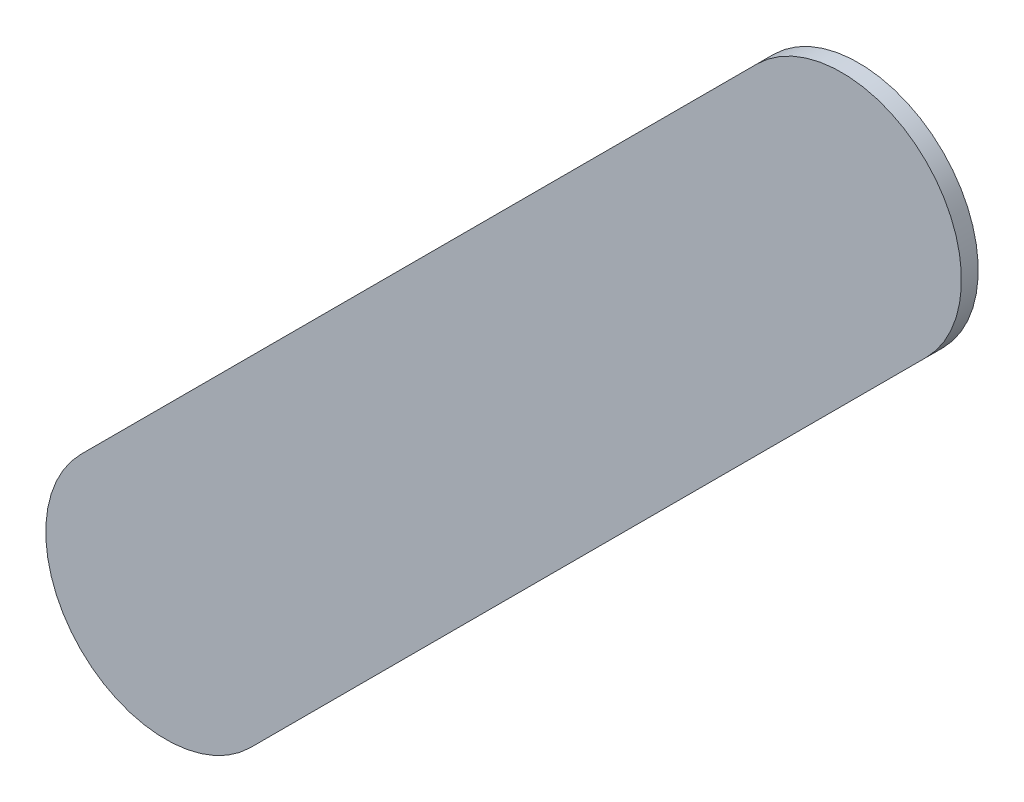
ISO-10303-21;
HEADER;
FILE_DESCRIPTION(('STEP AP214'),'2;1');
FILE_NAME('part.step','',(''),(''),'','','');
FILE_SCHEMA(('AUTOMOTIVE_DESIGN { 1 0 10303 214 1 1 1 1 }'));
ENDSEC;
DATA;
#1=APPLICATION_CONTEXT('core data for automotive mechanical design processes');
#2=APPLICATION_PROTOCOL_DEFINITION('international standard','automotive_design',2000,#1);
#3=PRODUCT_CONTEXT('',#1,'mechanical');
#4=PRODUCT('Part','Part','',(#3));
#5=PRODUCT_RELATED_PRODUCT_CATEGORY('part','',(#4));
#6=PRODUCT_DEFINITION_FORMATION('','',#4);
#7=PRODUCT_DEFINITION_CONTEXT('part definition',#1,'design');
#8=PRODUCT_DEFINITION('design','',#6,#7);
#9=PRODUCT_DEFINITION_SHAPE('','',#8);
#10=(LENGTH_UNIT() NAMED_UNIT(*) SI_UNIT(.MILLI.,.METRE.));
#11=(NAMED_UNIT(*) PLANE_ANGLE_UNIT() SI_UNIT($,.RADIAN.));
#12=(NAMED_UNIT(*) SI_UNIT($,.STERADIAN.) SOLID_ANGLE_UNIT());
#13=UNCERTAINTY_MEASURE_WITH_UNIT(LENGTH_MEASURE(1.E-05),#10,'distance_accuracy_value','');
#14=(GEOMETRIC_REPRESENTATION_CONTEXT(3) GLOBAL_UNCERTAINTY_ASSIGNED_CONTEXT((#13)) GLOBAL_UNIT_ASSIGNED_CONTEXT((#10,
#11,#12)) REPRESENTATION_CONTEXT('',''));
#15=CARTESIAN_POINT('',(0.,0.,0.));
#16=DIRECTION('',(0.,0.,1.));
#17=DIRECTION('',(1.,0.,0.));
#18=AXIS2_PLACEMENT_3D('',#15,#16,#17);
#19=CARTESIAN_POINT('',(134.528776,-110.680776,0.));
#20=DIRECTION('',(0.,0.,1.));
#21=DIRECTION('',(1.,0.,0.));
#22=AXIS2_PLACEMENT_3D('',#19,#20,#21);
#23=PLANE('',#22);
#24=DIRECTION('',(0.707106781186548,0.707106781186548,0.));
#25=VECTOR('',#24,1.);
#26=CARTESIAN_POINT('',(134.528776,-110.680776,0.));
#27=LINE('',#26,#25);
#28=CARTESIAN_POINT('',(134.528776,-110.680776,0.));
#29=VERTEX_POINT('',#28);
#30=CARTESIAN_POINT('',(135.939776,-109.269776,0.));
#31=VERTEX_POINT('',#30);
#32=EDGE_CURVE('E90',#29,#31,#27,.T.);
#33=ORIENTED_EDGE('',*,*,#32,.T.);
#34=CARTESIAN_POINT('',(135.7629995,-109.0929995,0.));
#35=DIRECTION('',(0.,0.,1.));
#36=DIRECTION('',(0.707106781186548,-0.707106781186548,0.));
#37=AXIS2_PLACEMENT_3D('',#34,#35,#36);
#38=CIRCLE('',#37,0.249999723809);
#39=CARTESIAN_POINT('',(135.586223,-108.916223,0.));
#40=VERTEX_POINT('',#39);
#41=EDGE_CURVE('E85',#31,#40,#38,.T.);
#42=ORIENTED_EDGE('',*,*,#41,.T.);
#43=DIRECTION('',(-0.707106781186548,-0.707106781186548,0.));
#44=VECTOR('',#43,1.);
#45=CARTESIAN_POINT('',(135.586223,-108.916223,0.));
#46=LINE('',#45,#44);
#47=CARTESIAN_POINT('',(134.175223,-110.327223,0.));
#48=VERTEX_POINT('',#47);
#49=EDGE_CURVE('E112',#40,#48,#46,.T.);
#50=ORIENTED_EDGE('',*,*,#49,.T.);
#51=CARTESIAN_POINT('',(134.3519995,-110.5039995,0.));
#52=DIRECTION('',(0.,0.,1.));
#53=DIRECTION('',(-0.707106781186548,0.707106781186548,0.));
#54=AXIS2_PLACEMENT_3D('',#51,#52,#53);
#55=CIRCLE('',#54,0.249999723809);
#56=EDGE_CURVE('E11',#48,#29,#55,.T.);
#57=ORIENTED_EDGE('',*,*,#56,.T.);
#58=EDGE_LOOP('',(#33,#42,#50,#57));
#59=FACE_BOUND('',#58,.T.);
#60=ADVANCED_FACE('F17',(#59),#23,.T.);
#61=CARTESIAN_POINT('',(134.528776,-110.680776,-0.035));
#62=DIRECTION('',(0.,0.,1.));
#63=DIRECTION('',(1.,0.,0.));
#64=AXIS2_PLACEMENT_3D('',#61,#62,#63);
#65=PLANE('',#64);
#66=CARTESIAN_POINT('',(134.3519995,-110.5039995,-0.035));
#67=DIRECTION('',(0.,0.,1.));
#68=DIRECTION('',(-0.707106781186548,0.707106781186548,0.));
#69=AXIS2_PLACEMENT_3D('',#66,#67,#68);
#70=CIRCLE('',#69,0.249999723809);
#71=CARTESIAN_POINT('',(134.175223,-110.327223,-0.035));
#72=VERTEX_POINT('',#71);
#73=CARTESIAN_POINT('',(134.528776,-110.680776,-0.035));
#74=VERTEX_POINT('',#73);
#75=EDGE_CURVE('E25',#72,#74,#70,.T.);
#76=ORIENTED_EDGE('',*,*,#75,.F.);
#77=DIRECTION('',(-0.707106781186548,-0.707106781186548,0.));
#78=VECTOR('',#77,1.);
#79=CARTESIAN_POINT('',(135.586223,-108.916223,-0.035));
#80=LINE('',#79,#78);
#81=CARTESIAN_POINT('',(135.586223,-108.916223,-0.035));
#82=VERTEX_POINT('',#81);
#83=EDGE_CURVE('E73',#82,#72,#80,.T.);
#84=ORIENTED_EDGE('',*,*,#83,.F.);
#85=CARTESIAN_POINT('',(135.7629995,-109.0929995,-0.035));
#86=DIRECTION('',(0.,0.,1.));
#87=DIRECTION('',(0.707106781186548,-0.707106781186548,0.));
#88=AXIS2_PLACEMENT_3D('',#85,#86,#87);
#89=CIRCLE('',#88,0.249999723809);
#90=CARTESIAN_POINT('',(135.939776,-109.269776,-0.035));
#91=VERTEX_POINT('',#90);
#92=EDGE_CURVE('E67',#91,#82,#89,.T.);
#93=ORIENTED_EDGE('',*,*,#92,.F.);
#94=DIRECTION('',(0.707106781186548,0.707106781186548,0.));
#95=VECTOR('',#94,1.);
#96=CARTESIAN_POINT('',(134.528776,-110.680776,-0.035));
#97=LINE('',#96,#95);
#98=EDGE_CURVE('E71',#74,#91,#97,.T.);
#99=ORIENTED_EDGE('',*,*,#98,.F.);
#100=EDGE_LOOP('',(#76,#84,#93,#99));
#101=FACE_BOUND('',#100,.T.);
#102=ADVANCED_FACE('F69',(#101),#65,.F.);
#103=CARTESIAN_POINT('',(134.3519995,-110.5039995,-0.035));
#104=DIRECTION('',(0.,0.,-1.));
#105=DIRECTION('',(-0.707106781186548,0.707106781186548,0.));
#106=AXIS2_PLACEMENT_3D('',#103,#104,#105);
#107=CYLINDRICAL_SURFACE('',#106,0.249999723809);
#108=ORIENTED_EDGE('',*,*,#75,.T.);
#109=DIRECTION('',(0.,0.,1.));
#110=VECTOR('',#109,1.);
#111=CARTESIAN_POINT('',(134.528776,-110.680776,-0.035));
#112=LINE('',#111,#110);
#113=EDGE_CURVE('E79',#74,#29,#112,.T.);
#114=ORIENTED_EDGE('',*,*,#113,.T.);
#115=ORIENTED_EDGE('',*,*,#56,.F.);
#116=DIRECTION('',(0.,0.,1.));
#117=VECTOR('',#116,1.);
#118=CARTESIAN_POINT('',(134.175223,-110.327223,-0.035));
#119=LINE('',#118,#117);
#120=EDGE_CURVE('E108',#72,#48,#119,.T.);
#121=ORIENTED_EDGE('',*,*,#120,.F.);
#122=EDGE_LOOP('',(#108,#114,#115,#121));
#123=FACE_BOUND('',#122,.T.);
#124=ADVANCED_FACE('F119',(#123),#107,.T.);
#125=CARTESIAN_POINT('',(135.586223,-108.916223,-0.035));
#126=DIRECTION('',(0.707106781186548,-0.707106781186548,0.));
#127=DIRECTION('',(0.,0.,-1.));
#128=AXIS2_PLACEMENT_3D('',#125,#126,#127);
#129=PLANE('',#128);
#130=ORIENTED_EDGE('',*,*,#83,.T.);
#131=ORIENTED_EDGE('',*,*,#120,.T.);
#132=ORIENTED_EDGE('',*,*,#49,.F.);
#133=DIRECTION('',(0.,0.,1.));
#134=VECTOR('',#133,1.);
#135=CARTESIAN_POINT('',(135.586223,-108.916223,-0.035));
#136=LINE('',#135,#134);
#137=EDGE_CURVE('E78',#82,#40,#136,.T.);
#138=ORIENTED_EDGE('',*,*,#137,.F.);
#139=EDGE_LOOP('',(#130,#131,#132,#138));
#140=FACE_BOUND('',#139,.T.);
#141=ADVANCED_FACE('F121',(#140),#129,.F.);
#142=CARTESIAN_POINT('',(135.7629995,-109.0929995,-0.035));
#143=DIRECTION('',(0.,0.,-1.));
#144=DIRECTION('',(0.707106781186548,-0.707106781186548,0.));
#145=AXIS2_PLACEMENT_3D('',#142,#143,#144);
#146=CYLINDRICAL_SURFACE('',#145,0.249999723809);
#147=ORIENTED_EDGE('',*,*,#92,.T.);
#148=ORIENTED_EDGE('',*,*,#137,.T.);
#149=ORIENTED_EDGE('',*,*,#41,.F.);
#150=DIRECTION('',(0.,0.,1.));
#151=VECTOR('',#150,1.);
#152=CARTESIAN_POINT('',(135.939776,-109.269776,-0.035));
#153=LINE('',#152,#151);
#154=EDGE_CURVE('E82',#91,#31,#153,.T.);
#155=ORIENTED_EDGE('',*,*,#154,.F.);
#156=EDGE_LOOP('',(#147,#148,#149,#155));
#157=FACE_BOUND('',#156,.T.);
#158=ADVANCED_FACE('F83',(#157),#146,.T.);
#159=CARTESIAN_POINT('',(134.528776,-110.680776,-0.035));
#160=DIRECTION('',(-0.707106781186548,0.707106781186548,0.));
#161=DIRECTION('',(0.,0.,1.));
#162=AXIS2_PLACEMENT_3D('',#159,#160,#161);
#163=PLANE('',#162);
#164=ORIENTED_EDGE('',*,*,#98,.T.);
#165=ORIENTED_EDGE('',*,*,#154,.T.);
#166=ORIENTED_EDGE('',*,*,#32,.F.);
#167=ORIENTED_EDGE('',*,*,#113,.F.);
#168=EDGE_LOOP('',(#164,#165,#166,#167));
#169=FACE_BOUND('',#168,.T.);
#170=ADVANCED_FACE('F93',(#169),#163,.F.);
#171=CLOSED_SHELL('',(#60,#102,#124,#141,#158,#170));
#172=MANIFOLD_SOLID_BREP('B1',#171);
#173=ADVANCED_BREP_SHAPE_REPRESENTATION('',(#18,#172),#14);
#174=SHAPE_DEFINITION_REPRESENTATION(#9,#173);
ENDSEC;
END-ISO-10303-21;
